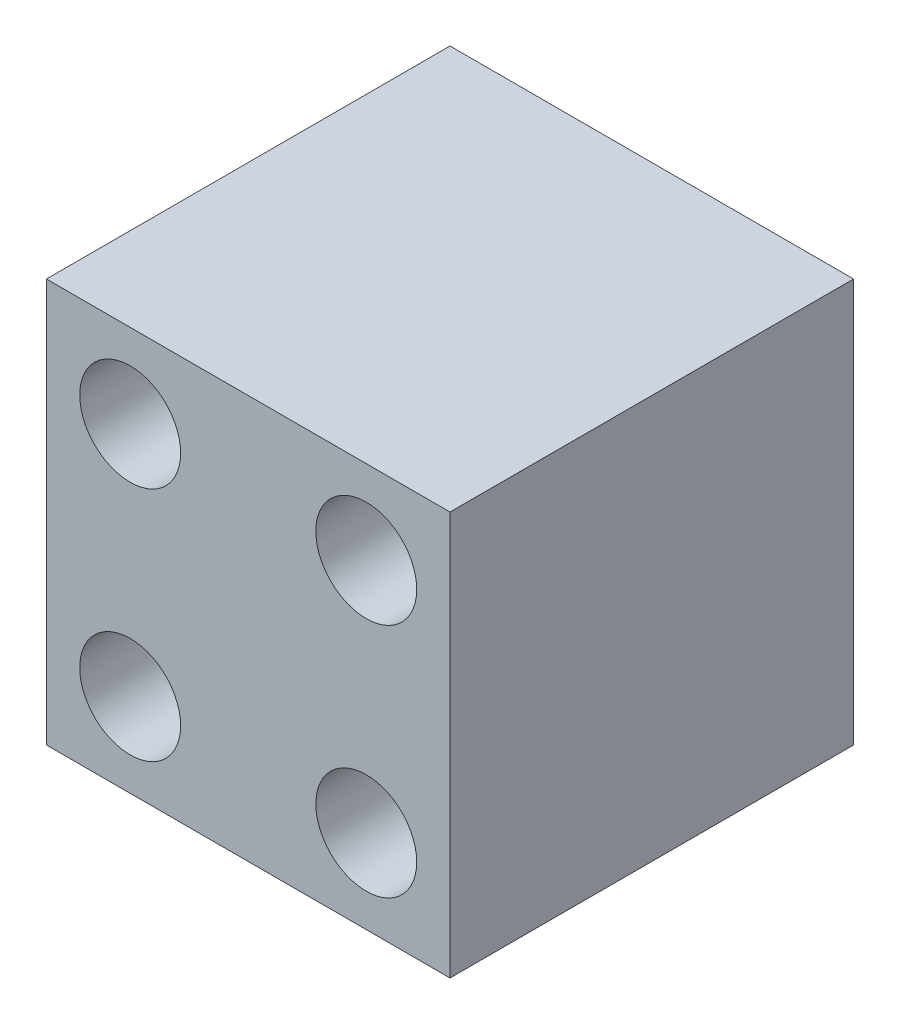
ISO-10303-21;
HEADER;
FILE_DESCRIPTION(('STEP AP214'),'2;1');
FILE_NAME('part.step','',(''),(''),'','','');
FILE_SCHEMA(('AUTOMOTIVE_DESIGN { 1 0 10303 214 1 1 1 1 }'));
ENDSEC;
DATA;
#1=APPLICATION_CONTEXT('core data for automotive mechanical design processes');
#2=APPLICATION_PROTOCOL_DEFINITION('international standard','automotive_design',2000,#1);
#3=PRODUCT_CONTEXT('',#1,'mechanical');
#4=PRODUCT('Part','Part','',(#3));
#5=PRODUCT_RELATED_PRODUCT_CATEGORY('part','',(#4));
#6=PRODUCT_DEFINITION_FORMATION('','',#4);
#7=PRODUCT_DEFINITION_CONTEXT('part definition',#1,'design');
#8=PRODUCT_DEFINITION('design','',#6,#7);
#9=PRODUCT_DEFINITION_SHAPE('','',#8);
#10=(LENGTH_UNIT() NAMED_UNIT(*) SI_UNIT(.MILLI.,.METRE.));
#11=(NAMED_UNIT(*) PLANE_ANGLE_UNIT() SI_UNIT($,.RADIAN.));
#12=(NAMED_UNIT(*) SI_UNIT($,.STERADIAN.) SOLID_ANGLE_UNIT());
#13=UNCERTAINTY_MEASURE_WITH_UNIT(LENGTH_MEASURE(1.E-05),#10,'distance_accuracy_value','');
#14=(GEOMETRIC_REPRESENTATION_CONTEXT(3) GLOBAL_UNCERTAINTY_ASSIGNED_CONTEXT((#13)) GLOBAL_UNIT_ASSIGNED_CONTEXT((#10,
#11,#12)) REPRESENTATION_CONTEXT('',''));
#15=CARTESIAN_POINT('',(0.,0.,0.));
#16=DIRECTION('',(0.,0.,1.));
#17=DIRECTION('',(1.,0.,0.));
#18=AXIS2_PLACEMENT_3D('',#15,#16,#17);
#19=CARTESIAN_POINT('',(0.,0.,40.));
#20=DIRECTION('',(0.,0.,-1.));
#21=DIRECTION('',(-1.,0.,0.));
#22=AXIS2_PLACEMENT_3D('',#19,#20,#21);
#23=PLANE('',#22);
#24=DIRECTION('',(0.,-1.,0.));
#25=VECTOR('',#24,1.);
#26=CARTESIAN_POINT('',(0.,0.,40.));
#27=LINE('',#26,#25);
#28=CARTESIAN_POINT('',(0.,40.,40.));
#29=VERTEX_POINT('',#28);
#30=CARTESIAN_POINT('',(0.,0.,40.));
#31=VERTEX_POINT('',#30);
#32=EDGE_CURVE('E98',#29,#31,#27,.T.);
#33=ORIENTED_EDGE('',*,*,#32,.T.);
#34=DIRECTION('',(1.,0.,0.));
#35=VECTOR('',#34,1.);
#36=CARTESIAN_POINT('',(0.,0.,40.));
#37=LINE('',#36,#35);
#38=CARTESIAN_POINT('',(40.,0.,40.));
#39=VERTEX_POINT('',#38);
#40=EDGE_CURVE('E93',#31,#39,#37,.T.);
#41=ORIENTED_EDGE('',*,*,#40,.T.);
#42=DIRECTION('',(0.,1.,0.));
#43=VECTOR('',#42,1.);
#44=CARTESIAN_POINT('',(40.,0.,40.));
#45=LINE('',#44,#43);
#46=CARTESIAN_POINT('',(40.,40.,40.));
#47=VERTEX_POINT('',#46);
#48=EDGE_CURVE('E96',#39,#47,#45,.T.);
#49=ORIENTED_EDGE('',*,*,#48,.T.);
#50=DIRECTION('',(-1.,0.,0.));
#51=VECTOR('',#50,1.);
#52=CARTESIAN_POINT('',(0.,40.,40.));
#53=LINE('',#52,#51);
#54=EDGE_CURVE('E63',#47,#29,#53,.T.);
#55=ORIENTED_EDGE('',*,*,#54,.T.);
#56=EDGE_LOOP('',(#33,#41,#49,#55));
#57=FACE_BOUND('',#56,.T.);
#58=CARTESIAN_POINT('',(8.3,31.7,40.));
#59=DIRECTION('',(0.,0.,1.));
#60=DIRECTION('',(1.,0.,0.));
#61=AXIS2_PLACEMENT_3D('',#58,#59,#60);
#62=CIRCLE('',#61,5.);
#63=CARTESIAN_POINT('',(13.3,31.7,40.));
#64=VERTEX_POINT('',#63);
#65=EDGE_CURVE('E118',#64,#64,#62,.T.);
#66=ORIENTED_EDGE('',*,*,#65,.F.);
#67=EDGE_LOOP('',(#66));
#68=FACE_BOUND('',#67,.T.);
#69=CARTESIAN_POINT('',(31.7,31.7,40.));
#70=DIRECTION('',(0.,0.,1.));
#71=DIRECTION('',(1.,0.,0.));
#72=AXIS2_PLACEMENT_3D('',#69,#70,#71);
#73=CIRCLE('',#72,5.);
#74=CARTESIAN_POINT('',(36.7,31.7,40.));
#75=VERTEX_POINT('',#74);
#76=EDGE_CURVE('E140',#75,#75,#73,.T.);
#77=ORIENTED_EDGE('',*,*,#76,.F.);
#78=EDGE_LOOP('',(#77));
#79=FACE_BOUND('',#78,.T.);
#80=CARTESIAN_POINT('',(8.3,8.3,40.));
#81=DIRECTION('',(0.,0.,1.));
#82=DIRECTION('',(1.,0.,0.));
#83=AXIS2_PLACEMENT_3D('',#80,#81,#82);
#84=CIRCLE('',#83,5.);
#85=CARTESIAN_POINT('',(13.3,8.3,40.));
#86=VERTEX_POINT('',#85);
#87=EDGE_CURVE('E148',#86,#86,#84,.T.);
#88=ORIENTED_EDGE('',*,*,#87,.F.);
#89=EDGE_LOOP('',(#88));
#90=FACE_BOUND('',#89,.T.);
#91=CARTESIAN_POINT('',(31.7,8.3,40.));
#92=DIRECTION('',(0.,0.,1.));
#93=DIRECTION('',(1.,0.,0.));
#94=AXIS2_PLACEMENT_3D('',#91,#92,#93);
#95=CIRCLE('',#94,5.);
#96=CARTESIAN_POINT('',(36.7,8.3,40.));
#97=VERTEX_POINT('',#96);
#98=EDGE_CURVE('E156',#97,#97,#95,.T.);
#99=ORIENTED_EDGE('',*,*,#98,.F.);
#100=EDGE_LOOP('',(#99));
#101=FACE_BOUND('',#100,.T.);
#102=ADVANCED_FACE('F45',(#57,#68,#79,#90,#101),#23,.F.);
#103=CARTESIAN_POINT('',(0.,0.,0.));
#104=DIRECTION('',(0.,0.,-1.));
#105=DIRECTION('',(-1.,0.,0.));
#106=AXIS2_PLACEMENT_3D('',#103,#104,#105);
#107=PLANE('',#106);
#108=CARTESIAN_POINT('',(8.3,8.3,0.));
#109=DIRECTION('',(0.,0.,1.));
#110=DIRECTION('',(1.,0.,0.));
#111=AXIS2_PLACEMENT_3D('',#108,#109,#110);
#112=CIRCLE('',#111,5.);
#113=CARTESIAN_POINT('',(13.3,8.3,0.));
#114=VERTEX_POINT('',#113);
#115=EDGE_CURVE('E152',#114,#114,#112,.T.);
#116=ORIENTED_EDGE('',*,*,#115,.T.);
#117=EDGE_LOOP('',(#116));
#118=FACE_BOUND('',#117,.T.);
#119=CARTESIAN_POINT('',(8.3,31.7,0.));
#120=DIRECTION('',(0.,0.,1.));
#121=DIRECTION('',(1.,0.,0.));
#122=AXIS2_PLACEMENT_3D('',#119,#120,#121);
#123=CIRCLE('',#122,5.);
#124=CARTESIAN_POINT('',(13.3,31.7,0.));
#125=VERTEX_POINT('',#124);
#126=EDGE_CURVE('E136',#125,#125,#123,.T.);
#127=ORIENTED_EDGE('',*,*,#126,.T.);
#128=EDGE_LOOP('',(#127));
#129=FACE_BOUND('',#128,.T.);
#130=DIRECTION('',(0.,-1.,0.));
#131=VECTOR('',#130,1.);
#132=CARTESIAN_POINT('',(0.,0.,0.));
#133=LINE('',#132,#131);
#134=CARTESIAN_POINT('',(0.,40.,0.));
#135=VERTEX_POINT('',#134);
#136=CARTESIAN_POINT('',(0.,0.,0.));
#137=VERTEX_POINT('',#136);
#138=EDGE_CURVE('E114',#135,#137,#133,.T.);
#139=ORIENTED_EDGE('',*,*,#138,.F.);
#140=DIRECTION('',(-1.,0.,0.));
#141=VECTOR('',#140,1.);
#142=CARTESIAN_POINT('',(0.,40.,0.));
#143=LINE('',#142,#141);
#144=CARTESIAN_POINT('',(40.,40.,0.));
#145=VERTEX_POINT('',#144);
#146=EDGE_CURVE('E86',#145,#135,#143,.T.);
#147=ORIENTED_EDGE('',*,*,#146,.F.);
#148=DIRECTION('',(0.,1.,0.));
#149=VECTOR('',#148,1.);
#150=CARTESIAN_POINT('',(40.,0.,0.));
#151=LINE('',#150,#149);
#152=CARTESIAN_POINT('',(40.,0.,0.));
#153=VERTEX_POINT('',#152);
#154=EDGE_CURVE('E80',#153,#145,#151,.T.);
#155=ORIENTED_EDGE('',*,*,#154,.F.);
#156=DIRECTION('',(1.,0.,0.));
#157=VECTOR('',#156,1.);
#158=CARTESIAN_POINT('',(0.,0.,0.));
#159=LINE('',#158,#157);
#160=EDGE_CURVE('E103',#137,#153,#159,.T.);
#161=ORIENTED_EDGE('',*,*,#160,.F.);
#162=EDGE_LOOP('',(#139,#147,#155,#161));
#163=FACE_BOUND('',#162,.T.);
#164=CARTESIAN_POINT('',(31.7,31.7,0.));
#165=DIRECTION('',(0.,0.,1.));
#166=DIRECTION('',(1.,0.,0.));
#167=AXIS2_PLACEMENT_3D('',#164,#165,#166);
#168=CIRCLE('',#167,5.);
#169=CARTESIAN_POINT('',(36.7,31.7,0.));
#170=VERTEX_POINT('',#169);
#171=EDGE_CURVE('E144',#170,#170,#168,.T.);
#172=ORIENTED_EDGE('',*,*,#171,.T.);
#173=EDGE_LOOP('',(#172));
#174=FACE_BOUND('',#173,.T.);
#175=CARTESIAN_POINT('',(31.7,8.3,0.));
#176=DIRECTION('',(0.,0.,1.));
#177=DIRECTION('',(1.,0.,0.));
#178=AXIS2_PLACEMENT_3D('',#175,#176,#177);
#179=CIRCLE('',#178,5.);
#180=CARTESIAN_POINT('',(36.7,8.3,0.));
#181=VERTEX_POINT('',#180);
#182=EDGE_CURVE('E160',#181,#181,#179,.T.);
#183=ORIENTED_EDGE('',*,*,#182,.T.);
#184=EDGE_LOOP('',(#183));
#185=FACE_BOUND('',#184,.T.);
#186=ADVANCED_FACE('F131',(#118,#129,#163,#174,#185),#107,.T.);
#187=CARTESIAN_POINT('',(0.,0.,40.));
#188=DIRECTION('',(1.,0.,0.));
#189=DIRECTION('',(0.,0.,-1.));
#190=AXIS2_PLACEMENT_3D('',#187,#188,#189);
#191=PLANE('',#190);
#192=ORIENTED_EDGE('',*,*,#138,.T.);
#193=DIRECTION('',(0.,0.,-1.));
#194=VECTOR('',#193,1.);
#195=CARTESIAN_POINT('',(0.,0.,40.));
#196=LINE('',#195,#194);
#197=EDGE_CURVE('E11',#31,#137,#196,.T.);
#198=ORIENTED_EDGE('',*,*,#197,.F.);
#199=ORIENTED_EDGE('',*,*,#32,.F.);
#200=DIRECTION('',(0.,0.,-1.));
#201=VECTOR('',#200,1.);
#202=CARTESIAN_POINT('',(0.,40.,40.));
#203=LINE('',#202,#201);
#204=EDGE_CURVE('E110',#29,#135,#203,.T.);
#205=ORIENTED_EDGE('',*,*,#204,.T.);
#206=EDGE_LOOP('',(#192,#198,#199,#205));
#207=FACE_BOUND('',#206,.T.);
#208=ADVANCED_FACE('F47',(#207),#191,.F.);
#209=CARTESIAN_POINT('',(0.,0.,40.));
#210=DIRECTION('',(0.,1.,0.));
#211=DIRECTION('',(0.,0.,1.));
#212=AXIS2_PLACEMENT_3D('',#209,#210,#211);
#213=PLANE('',#212);
#214=ORIENTED_EDGE('',*,*,#160,.T.);
#215=DIRECTION('',(0.,0.,-1.));
#216=VECTOR('',#215,1.);
#217=CARTESIAN_POINT('',(40.,0.,40.));
#218=LINE('',#217,#216);
#219=EDGE_CURVE('E55',#39,#153,#218,.T.);
#220=ORIENTED_EDGE('',*,*,#219,.F.);
#221=ORIENTED_EDGE('',*,*,#40,.F.);
#222=ORIENTED_EDGE('',*,*,#197,.T.);
#223=EDGE_LOOP('',(#214,#220,#221,#222));
#224=FACE_BOUND('',#223,.T.);
#225=ADVANCED_FACE('F102',(#224),#213,.F.);
#226=CARTESIAN_POINT('',(40.,0.,40.));
#227=DIRECTION('',(-1.,0.,0.));
#228=DIRECTION('',(0.,0.,1.));
#229=AXIS2_PLACEMENT_3D('',#226,#227,#228);
#230=PLANE('',#229);
#231=ORIENTED_EDGE('',*,*,#154,.T.);
#232=DIRECTION('',(0.,0.,-1.));
#233=VECTOR('',#232,1.);
#234=CARTESIAN_POINT('',(40.,40.,40.));
#235=LINE('',#234,#233);
#236=EDGE_CURVE('E105',#47,#145,#235,.T.);
#237=ORIENTED_EDGE('',*,*,#236,.F.);
#238=ORIENTED_EDGE('',*,*,#48,.F.);
#239=ORIENTED_EDGE('',*,*,#219,.T.);
#240=EDGE_LOOP('',(#231,#237,#238,#239));
#241=FACE_BOUND('',#240,.T.);
#242=ADVANCED_FACE('F106',(#241),#230,.F.);
#243=CARTESIAN_POINT('',(0.,40.,40.));
#244=DIRECTION('',(0.,-1.,0.));
#245=DIRECTION('',(0.,0.,-1.));
#246=AXIS2_PLACEMENT_3D('',#243,#244,#245);
#247=PLANE('',#246);
#248=ORIENTED_EDGE('',*,*,#146,.T.);
#249=ORIENTED_EDGE('',*,*,#204,.F.);
#250=ORIENTED_EDGE('',*,*,#54,.F.);
#251=ORIENTED_EDGE('',*,*,#236,.T.);
#252=EDGE_LOOP('',(#248,#249,#250,#251));
#253=FACE_BOUND('',#252,.T.);
#254=ADVANCED_FACE('F128',(#253),#247,.F.);
#255=CARTESIAN_POINT('',(8.3,31.7,40.));
#256=DIRECTION('',(0.,0.,-1.));
#257=DIRECTION('',(-1.,0.,0.));
#258=AXIS2_PLACEMENT_3D('',#255,#256,#257);
#259=CYLINDRICAL_SURFACE('',#258,5.);
#260=ORIENTED_EDGE('',*,*,#65,.T.);
#261=EDGE_LOOP('',(#260));
#262=FACE_BOUND('',#261,.T.);
#263=ORIENTED_EDGE('',*,*,#126,.F.);
#264=EDGE_LOOP('',(#263));
#265=FACE_BOUND('',#264,.T.);
#266=ADVANCED_FACE('F179',(#262,#265),#259,.F.);
#267=CARTESIAN_POINT('',(31.7,31.7,40.));
#268=DIRECTION('',(0.,0.,-1.));
#269=DIRECTION('',(-1.,0.,0.));
#270=AXIS2_PLACEMENT_3D('',#267,#268,#269);
#271=CYLINDRICAL_SURFACE('',#270,5.);
#272=ORIENTED_EDGE('',*,*,#76,.T.);
#273=EDGE_LOOP('',(#272));
#274=FACE_BOUND('',#273,.T.);
#275=ORIENTED_EDGE('',*,*,#171,.F.);
#276=EDGE_LOOP('',(#275));
#277=FACE_BOUND('',#276,.T.);
#278=ADVANCED_FACE('F224',(#274,#277),#271,.F.);
#279=CARTESIAN_POINT('',(8.3,8.3,40.));
#280=DIRECTION('',(0.,0.,-1.));
#281=DIRECTION('',(-1.,0.,0.));
#282=AXIS2_PLACEMENT_3D('',#279,#280,#281);
#283=CYLINDRICAL_SURFACE('',#282,5.);
#284=ORIENTED_EDGE('',*,*,#87,.T.);
#285=EDGE_LOOP('',(#284));
#286=FACE_BOUND('',#285,.T.);
#287=ORIENTED_EDGE('',*,*,#115,.F.);
#288=EDGE_LOOP('',(#287));
#289=FACE_BOUND('',#288,.T.);
#290=ADVANCED_FACE('F232',(#286,#289),#283,.F.);
#291=CARTESIAN_POINT('',(31.7,8.3,40.));
#292=DIRECTION('',(0.,0.,-1.));
#293=DIRECTION('',(-1.,0.,0.));
#294=AXIS2_PLACEMENT_3D('',#291,#292,#293);
#295=CYLINDRICAL_SURFACE('',#294,5.);
#296=ORIENTED_EDGE('',*,*,#98,.T.);
#297=EDGE_LOOP('',(#296));
#298=FACE_BOUND('',#297,.T.);
#299=ORIENTED_EDGE('',*,*,#182,.F.);
#300=EDGE_LOOP('',(#299));
#301=FACE_BOUND('',#300,.T.);
#302=ADVANCED_FACE('F168',(#298,#301),#295,.F.);
#303=CLOSED_SHELL('',(#102,#186,#208,#225,#242,#254,#266,#278,#290,#302));
#304=MANIFOLD_SOLID_BREP('B2',#303);
#305=ADVANCED_BREP_SHAPE_REPRESENTATION('',(#18,#304),#14);
#306=SHAPE_DEFINITION_REPRESENTATION(#9,#305);
ENDSEC;
END-ISO-10303-21;
